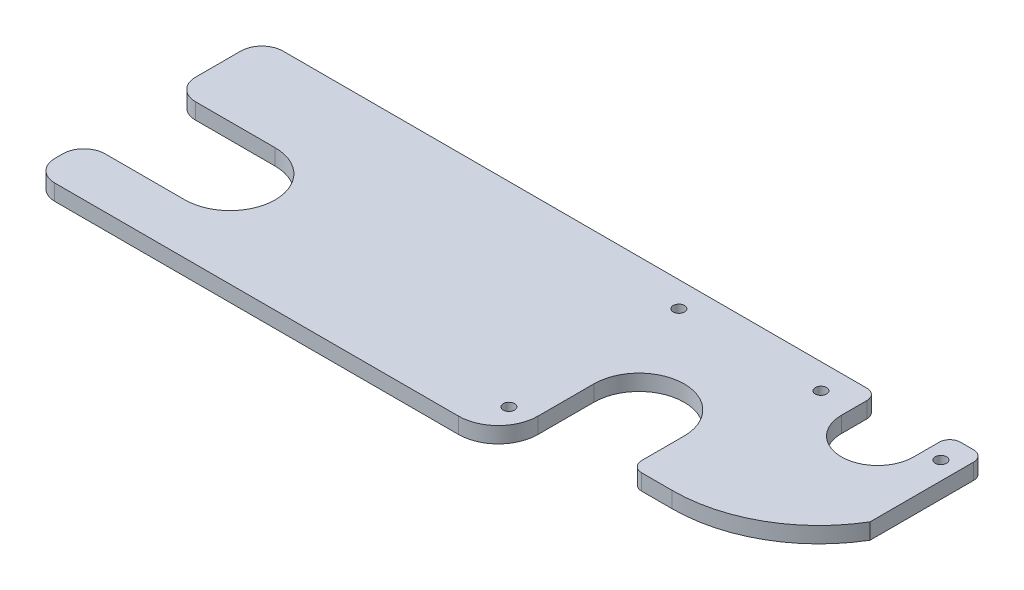
ISO-10303-21;
HEADER;
FILE_DESCRIPTION(('STEP AP214'),'2;1');
FILE_NAME('part.step','',(''),(''),'','','');
FILE_SCHEMA(('AUTOMOTIVE_DESIGN { 1 0 10303 214 1 1 1 1 }'));
ENDSEC;
DATA;
#1=APPLICATION_CONTEXT('core data for automotive mechanical design processes');
#2=APPLICATION_PROTOCOL_DEFINITION('international standard','automotive_design',2000,#1);
#3=PRODUCT_CONTEXT('',#1,'mechanical');
#4=PRODUCT('Part','Part','',(#3));
#5=PRODUCT_RELATED_PRODUCT_CATEGORY('part','',(#4));
#6=PRODUCT_DEFINITION_FORMATION('','',#4);
#7=PRODUCT_DEFINITION_CONTEXT('part definition',#1,'design');
#8=PRODUCT_DEFINITION('design','',#6,#7);
#9=PRODUCT_DEFINITION_SHAPE('','',#8);
#10=(LENGTH_UNIT() NAMED_UNIT(*) SI_UNIT(.MILLI.,.METRE.));
#11=(NAMED_UNIT(*) PLANE_ANGLE_UNIT() SI_UNIT($,.RADIAN.));
#12=(NAMED_UNIT(*) SI_UNIT($,.STERADIAN.) SOLID_ANGLE_UNIT());
#13=UNCERTAINTY_MEASURE_WITH_UNIT(LENGTH_MEASURE(1.E-05),#10,'distance_accuracy_value','');
#14=(GEOMETRIC_REPRESENTATION_CONTEXT(3) GLOBAL_UNCERTAINTY_ASSIGNED_CONTEXT((#13)) GLOBAL_UNIT_ASSIGNED_CONTEXT((#10,
#11,#12)) REPRESENTATION_CONTEXT('',''));
#15=CARTESIAN_POINT('',(0.,0.,0.));
#16=DIRECTION('',(0.,0.,1.));
#17=DIRECTION('',(1.,0.,0.));
#18=AXIS2_PLACEMENT_3D('',#15,#16,#17);
#19=CARTESIAN_POINT('',(12.7,9.525,-123.825));
#20=DIRECTION('',(0.,-1.,0.));
#21=DIRECTION('',(0.,0.,-1.));
#22=AXIS2_PLACEMENT_3D('',#19,#20,#21);
#23=CYLINDRICAL_SURFACE('',#22,12.7);
#24=CARTESIAN_POINT('',(12.7,0.,-123.825));
#25=DIRECTION('',(0.,-1.,0.));
#26=DIRECTION('',(0.,0.,-1.));
#27=AXIS2_PLACEMENT_3D('',#24,#25,#26);
#28=CIRCLE('',#27,12.7);
#29=CARTESIAN_POINT('',(0.,0.,-123.825));
#30=VERTEX_POINT('',#29);
#31=CARTESIAN_POINT('',(12.7,0.,-136.525));
#32=VERTEX_POINT('',#31);
#33=EDGE_CURVE('E382',#30,#32,#28,.T.);
#34=ORIENTED_EDGE('',*,*,#33,.F.);
#35=DIRECTION('',(0.,-1.,0.));
#36=VECTOR('',#35,1.);
#37=CARTESIAN_POINT('',(0.,9.525,-123.825));
#38=LINE('',#37,#36);
#39=CARTESIAN_POINT('',(0.,9.525,-123.825));
#40=VERTEX_POINT('',#39);
#41=EDGE_CURVE('E388',#40,#30,#38,.T.);
#42=ORIENTED_EDGE('',*,*,#41,.F.);
#43=CARTESIAN_POINT('',(12.7,9.525,-123.825));
#44=DIRECTION('',(0.,-1.,0.));
#45=DIRECTION('',(0.,0.,-1.));
#46=AXIS2_PLACEMENT_3D('',#43,#44,#45);
#47=CIRCLE('',#46,12.7);
#48=CARTESIAN_POINT('',(12.7,9.525,-136.525));
#49=VERTEX_POINT('',#48);
#50=EDGE_CURVE('E243',#40,#49,#47,.T.);
#51=ORIENTED_EDGE('',*,*,#50,.T.);
#52=DIRECTION('',(0.,-1.,0.));
#53=VECTOR('',#52,1.);
#54=CARTESIAN_POINT('',(12.7,9.525,-136.525));
#55=LINE('',#54,#53);
#56=EDGE_CURVE('E248',#49,#32,#55,.T.);
#57=ORIENTED_EDGE('',*,*,#56,.T.);
#58=EDGE_LOOP('',(#34,#42,#51,#57));
#59=FACE_BOUND('',#58,.T.);
#60=ADVANCED_FACE('F32',(#59),#23,.T.);
#61=CARTESIAN_POINT('',(0.,9.525,-96.8375000000001));
#62=DIRECTION('',(-1.,0.,0.));
#63=DIRECTION('',(0.,0.,1.));
#64=AXIS2_PLACEMENT_3D('',#61,#62,#63);
#65=PLANE('',#64);
#66=DIRECTION('',(0.,0.,-1.));
#67=VECTOR('',#66,1.);
#68=CARTESIAN_POINT('',(0.,0.,-96.8375000000001));
#69=LINE('',#68,#67);
#70=CARTESIAN_POINT('',(0.,0.,-96.8375));
#71=VERTEX_POINT('',#70);
#72=EDGE_CURVE('E380',#71,#30,#69,.T.);
#73=ORIENTED_EDGE('',*,*,#72,.F.);
#74=DIRECTION('',(0.,-1.,0.));
#75=VECTOR('',#74,1.);
#76=CARTESIAN_POINT('',(0.,9.525,-96.8375000000001));
#77=LINE('',#76,#75);
#78=CARTESIAN_POINT('',(0.,9.525,-96.8375));
#79=VERTEX_POINT('',#78);
#80=EDGE_CURVE('E270',#71,#79,#77,.F.);
#81=ORIENTED_EDGE('',*,*,#80,.T.);
#82=DIRECTION('',(0.,0.,-1.));
#83=VECTOR('',#82,1.);
#84=CARTESIAN_POINT('',(0.,9.525,-84.1375));
#85=LINE('',#84,#83);
#86=EDGE_CURVE('E343',#79,#40,#85,.T.);
#87=ORIENTED_EDGE('',*,*,#86,.T.);
#88=ORIENTED_EDGE('',*,*,#41,.T.);
#89=EDGE_LOOP('',(#73,#81,#87,#88));
#90=FACE_BOUND('',#89,.T.);
#91=ADVANCED_FACE('F448',(#90),#65,.T.);
#92=CARTESIAN_POINT('',(22.2250000000001,9.525,-84.1375));
#93=DIRECTION('',(0.,0.,1.));
#94=DIRECTION('',(1.,0.,0.));
#95=AXIS2_PLACEMENT_3D('',#92,#93,#94);
#96=PLANE('',#95);
#97=DIRECTION('',(-1.,0.,0.));
#98=VECTOR('',#97,1.);
#99=CARTESIAN_POINT('',(60.325,9.525,-84.1375));
#100=LINE('',#99,#98);
#101=CARTESIAN_POINT('',(60.325,9.525,-84.1375));
#102=VERTEX_POINT('',#101);
#103=CARTESIAN_POINT('',(12.7,9.525,-84.1375));
#104=VERTEX_POINT('',#103);
#105=EDGE_CURVE('E340',#102,#104,#100,.T.);
#106=ORIENTED_EDGE('',*,*,#105,.T.);
#107=DIRECTION('',(0.,-1.,0.));
#108=VECTOR('',#107,1.);
#109=CARTESIAN_POINT('',(12.7,9.525,-84.1375));
#110=LINE('',#109,#108);
#111=CARTESIAN_POINT('',(12.7,0.,-84.1375));
#112=VERTEX_POINT('',#111);
#113=EDGE_CURVE('E267',#104,#112,#110,.T.);
#114=ORIENTED_EDGE('',*,*,#113,.T.);
#115=DIRECTION('',(-1.,0.,0.));
#116=VECTOR('',#115,1.);
#117=CARTESIAN_POINT('',(22.2250000000001,0.,-84.1375));
#118=LINE('',#117,#116);
#119=CARTESIAN_POINT('',(60.325,0.,-84.1375));
#120=VERTEX_POINT('',#119);
#121=EDGE_CURVE('E377',#120,#112,#118,.T.);
#122=ORIENTED_EDGE('',*,*,#121,.F.);
#123=DIRECTION('',(0.,-1.,0.));
#124=VECTOR('',#123,1.);
#125=CARTESIAN_POINT('',(60.325,9.525,-84.1375));
#126=LINE('',#125,#124);
#127=EDGE_CURVE('E391',#102,#120,#126,.T.);
#128=ORIENTED_EDGE('',*,*,#127,.F.);
#129=EDGE_LOOP('',(#106,#114,#122,#128));
#130=FACE_BOUND('',#129,.T.);
#131=ADVANCED_FACE('F442',(#130),#96,.T.);
#132=CARTESIAN_POINT('',(60.325,9.525,-57.15));
#133=DIRECTION('',(0.,-1.,0.));
#134=DIRECTION('',(0.,0.,-1.));
#135=AXIS2_PLACEMENT_3D('',#132,#133,#134);
#136=CYLINDRICAL_SURFACE('',#135,26.9875);
#137=CARTESIAN_POINT('',(60.325,0.,-57.15));
#138=DIRECTION('',(0.,-1.,0.));
#139=DIRECTION('',(0.,0.,-1.));
#140=AXIS2_PLACEMENT_3D('',#137,#138,#139);
#141=CIRCLE('',#140,26.9875);
#142=CARTESIAN_POINT('',(60.325,0.,-30.1625));
#143=VERTEX_POINT('',#142);
#144=EDGE_CURVE('E375',#120,#143,#141,.T.);
#145=ORIENTED_EDGE('',*,*,#144,.T.);
#146=DIRECTION('',(0.,-1.,0.));
#147=VECTOR('',#146,1.);
#148=CARTESIAN_POINT('',(60.325,9.525,-30.1625));
#149=LINE('',#148,#147);
#150=CARTESIAN_POINT('',(60.325,9.525,-30.1625));
#151=VERTEX_POINT('',#150);
#152=EDGE_CURVE('E394',#151,#143,#149,.T.);
#153=ORIENTED_EDGE('',*,*,#152,.F.);
#154=CARTESIAN_POINT('',(60.325,9.525,-57.15));
#155=DIRECTION('',(0.,1.,0.));
#156=DIRECTION('',(0.,0.,1.));
#157=AXIS2_PLACEMENT_3D('',#154,#155,#156);
#158=CIRCLE('',#157,26.9875);
#159=EDGE_CURVE('E338',#151,#102,#158,.T.);
#160=ORIENTED_EDGE('',*,*,#159,.T.);
#161=ORIENTED_EDGE('',*,*,#127,.T.);
#162=EDGE_LOOP('',(#145,#153,#160,#161));
#163=FACE_BOUND('',#162,.T.);
#164=ADVANCED_FACE('F439',(#163),#136,.F.);
#165=CARTESIAN_POINT('',(60.325,9.525,-30.1625));
#166=DIRECTION('',(0.,0.,1.));
#167=DIRECTION('',(1.,0.,0.));
#168=AXIS2_PLACEMENT_3D('',#165,#166,#167);
#169=PLANE('',#168);
#170=DIRECTION('',(-1.,0.,0.));
#171=VECTOR('',#170,1.);
#172=CARTESIAN_POINT('',(60.325,0.,-30.1625));
#173=LINE('',#172,#171);
#174=CARTESIAN_POINT('',(12.7,0.,-30.1625));
#175=VERTEX_POINT('',#174);
#176=EDGE_CURVE('E372',#143,#175,#173,.T.);
#177=ORIENTED_EDGE('',*,*,#176,.T.);
#178=DIRECTION('',(0.,-1.,0.));
#179=VECTOR('',#178,1.);
#180=CARTESIAN_POINT('',(12.7,9.525,-30.1625));
#181=LINE('',#180,#179);
#182=CARTESIAN_POINT('',(12.7,9.525,-30.1625));
#183=VERTEX_POINT('',#182);
#184=EDGE_CURVE('E261',#175,#183,#181,.F.);
#185=ORIENTED_EDGE('',*,*,#184,.T.);
#186=DIRECTION('',(-1.,0.,0.));
#187=VECTOR('',#186,1.);
#188=CARTESIAN_POINT('',(22.2250000000001,9.525,-30.1625));
#189=LINE('',#188,#187);
#190=EDGE_CURVE('E335',#151,#183,#189,.T.);
#191=ORIENTED_EDGE('',*,*,#190,.F.);
#192=ORIENTED_EDGE('',*,*,#152,.T.);
#193=EDGE_LOOP('',(#177,#185,#191,#192));
#194=FACE_BOUND('',#193,.T.);
#195=ADVANCED_FACE('F433',(#194),#169,.F.);
#196=CARTESIAN_POINT('',(0.,9.525,-30.1625));
#197=DIRECTION('',(1.,0.,0.));
#198=DIRECTION('',(0.,0.,-1.));
#199=AXIS2_PLACEMENT_3D('',#196,#197,#198);
#200=PLANE('',#199);
#201=DIRECTION('',(0.,0.,1.));
#202=VECTOR('',#201,1.);
#203=CARTESIAN_POINT('',(0.,9.525,-17.4624999999999));
#204=LINE('',#203,#202);
#205=CARTESIAN_POINT('',(0.,9.525,-17.4625));
#206=VERTEX_POINT('',#205);
#207=CARTESIAN_POINT('',(0.,9.525,-12.7000000000001));
#208=VERTEX_POINT('',#207);
#209=EDGE_CURVE('E333',#206,#208,#204,.T.);
#210=ORIENTED_EDGE('',*,*,#209,.F.);
#211=DIRECTION('',(0.,-1.,0.));
#212=VECTOR('',#211,1.);
#213=CARTESIAN_POINT('',(0.,9.525,-17.4625));
#214=LINE('',#213,#212);
#215=CARTESIAN_POINT('',(0.,0.,-17.4625));
#216=VERTEX_POINT('',#215);
#217=EDGE_CURVE('E254',#206,#216,#214,.T.);
#218=ORIENTED_EDGE('',*,*,#217,.T.);
#219=DIRECTION('',(0.,0.,1.));
#220=VECTOR('',#219,1.);
#221=CARTESIAN_POINT('',(0.,0.,-30.1625));
#222=LINE('',#221,#220);
#223=CARTESIAN_POINT('',(0.,0.,-12.7000000000001));
#224=VERTEX_POINT('',#223);
#225=EDGE_CURVE('E370',#216,#224,#222,.T.);
#226=ORIENTED_EDGE('',*,*,#225,.T.);
#227=DIRECTION('',(0.,-1.,0.));
#228=VECTOR('',#227,1.);
#229=CARTESIAN_POINT('',(0.,9.525,-12.7000000000001));
#230=LINE('',#229,#228);
#231=EDGE_CURVE('E397',#208,#224,#230,.T.);
#232=ORIENTED_EDGE('',*,*,#231,.F.);
#233=EDGE_LOOP('',(#210,#218,#226,#232));
#234=FACE_BOUND('',#233,.T.);
#235=ADVANCED_FACE('F426',(#234),#200,.F.);
#236=CARTESIAN_POINT('',(12.7,9.525,-12.7));
#237=DIRECTION('',(0.,-1.,0.));
#238=DIRECTION('',(0.,0.,-1.));
#239=AXIS2_PLACEMENT_3D('',#236,#237,#238);
#240=CYLINDRICAL_SURFACE('',#239,12.7);
#241=CARTESIAN_POINT('',(12.7,0.,-12.7));
#242=DIRECTION('',(0.,1.,0.));
#243=DIRECTION('',(0.,0.,1.));
#244=AXIS2_PLACEMENT_3D('',#241,#242,#243);
#245=CIRCLE('',#244,12.7);
#246=CARTESIAN_POINT('',(12.7000000000001,0.,0.));
#247=VERTEX_POINT('',#246);
#248=EDGE_CURVE('E368',#224,#247,#245,.T.);
#249=ORIENTED_EDGE('',*,*,#248,.T.);
#250=DIRECTION('',(0.,-1.,0.));
#251=VECTOR('',#250,1.);
#252=CARTESIAN_POINT('',(12.7000000000001,9.525,0.));
#253=LINE('',#252,#251);
#254=CARTESIAN_POINT('',(12.7000000000001,9.525,0.));
#255=VERTEX_POINT('',#254);
#256=EDGE_CURVE('E400',#255,#247,#253,.T.);
#257=ORIENTED_EDGE('',*,*,#256,.F.);
#258=CARTESIAN_POINT('',(12.7,9.525,-12.7));
#259=DIRECTION('',(0.,1.,0.));
#260=DIRECTION('',(0.,0.,1.));
#261=AXIS2_PLACEMENT_3D('',#258,#259,#260);
#262=CIRCLE('',#261,12.7);
#263=EDGE_CURVE('E330',#208,#255,#262,.T.);
#264=ORIENTED_EDGE('',*,*,#263,.F.);
#265=ORIENTED_EDGE('',*,*,#231,.T.);
#266=EDGE_LOOP('',(#249,#257,#264,#265));
#267=FACE_BOUND('',#266,.T.);
#268=ADVANCED_FACE('F420',(#267),#240,.T.);
#269=CARTESIAN_POINT('',(12.7000000000001,9.525,0.));
#270=DIRECTION('',(0.,0.,-1.));
#271=DIRECTION('',(-1.,0.,0.));
#272=AXIS2_PLACEMENT_3D('',#269,#270,#271);
#273=PLANE('',#272);
#274=DIRECTION('',(1.,0.,0.));
#275=VECTOR('',#274,1.);
#276=CARTESIAN_POINT('',(12.7000000000001,0.,0.));
#277=LINE('',#276,#275);
#278=CARTESIAN_POINT('',(254.,0.,0.));
#279=VERTEX_POINT('',#278);
#280=EDGE_CURVE('E365',#247,#279,#277,.T.);
#281=ORIENTED_EDGE('',*,*,#280,.T.);
#282=DIRECTION('',(0.,-1.,0.));
#283=VECTOR('',#282,1.);
#284=CARTESIAN_POINT('',(254.,9.525,0.));
#285=LINE('',#284,#283);
#286=CARTESIAN_POINT('',(254.,9.525,0.));
#287=VERTEX_POINT('',#286);
#288=EDGE_CURVE('E250',#279,#287,#285,.F.);
#289=ORIENTED_EDGE('',*,*,#288,.T.);
#290=DIRECTION('',(1.,0.,0.));
#291=VECTOR('',#290,1.);
#292=CARTESIAN_POINT('',(25.4,9.525,0.));
#293=LINE('',#292,#291);
#294=EDGE_CURVE('E327',#255,#287,#293,.T.);
#295=ORIENTED_EDGE('',*,*,#294,.F.);
#296=ORIENTED_EDGE('',*,*,#256,.T.);
#297=EDGE_LOOP('',(#281,#289,#295,#296));
#298=FACE_BOUND('',#297,.T.);
#299=ADVANCED_FACE('F416',(#298),#273,.F.);
#300=CARTESIAN_POINT('',(277.8125,9.525,-57.15));
#301=DIRECTION('',(1.,0.,0.));
#302=DIRECTION('',(0.,0.,-1.));
#303=AXIS2_PLACEMENT_3D('',#300,#301,#302);
#304=PLANE('',#303);
#305=DIRECTION('',(0.,0.,1.));
#306=VECTOR('',#305,1.);
#307=CARTESIAN_POINT('',(277.8125,9.525,-57.15));
#308=LINE('',#307,#306);
#309=CARTESIAN_POINT('',(277.812500035128,9.525,-57.15));
#310=VERTEX_POINT('',#309);
#311=CARTESIAN_POINT('',(277.8125,9.525,-23.8125));
#312=VERTEX_POINT('',#311);
#313=EDGE_CURVE('E319',#310,#312,#308,.T.);
#314=ORIENTED_EDGE('',*,*,#313,.T.);
#315=DIRECTION('',(0.,-1.,0.));
#316=VECTOR('',#315,1.);
#317=CARTESIAN_POINT('',(277.8125,0.,-23.8125));
#318=LINE('',#317,#316);
#319=CARTESIAN_POINT('',(277.8125,0.,-23.8125));
#320=VERTEX_POINT('',#319);
#321=EDGE_CURVE('E244',#312,#320,#318,.T.);
#322=ORIENTED_EDGE('',*,*,#321,.T.);
#323=DIRECTION('',(0.,0.,1.));
#324=VECTOR('',#323,1.);
#325=CARTESIAN_POINT('',(277.8125,0.,-57.15));
#326=LINE('',#325,#324);
#327=CARTESIAN_POINT('',(277.812500035128,0.,-57.15));
#328=VERTEX_POINT('',#327);
#329=EDGE_CURVE('E362',#328,#320,#326,.T.);
#330=ORIENTED_EDGE('',*,*,#329,.F.);
#331=DIRECTION('',(0.,-1.,0.));
#332=VECTOR('',#331,1.);
#333=CARTESIAN_POINT('',(277.812500035128,9.525,-57.15));
#334=LINE('',#333,#332);
#335=EDGE_CURVE('E236',#310,#328,#334,.T.);
#336=ORIENTED_EDGE('',*,*,#335,.F.);
#337=EDGE_LOOP('',(#314,#322,#330,#336));
#338=FACE_BOUND('',#337,.T.);
#339=ADVANCED_FACE('F407',(#338),#304,.T.);
#340=CARTESIAN_POINT('',(304.8,9.525,-57.15));
#341=DIRECTION('',(0.,-1.,0.));
#342=DIRECTION('',(0.,0.,-1.));
#343=AXIS2_PLACEMENT_3D('',#340,#341,#342);
#344=CYLINDRICAL_SURFACE('',#343,26.9874999648723);
#345=CARTESIAN_POINT('',(304.8,0.,-57.15));
#346=DIRECTION('',(0.,-1.,0.));
#347=DIRECTION('',(0.,0.,-1.));
#348=AXIS2_PLACEMENT_3D('',#345,#346,#347);
#349=CIRCLE('',#348,26.9874999648723);
#350=CARTESIAN_POINT('',(331.787499929745,0.,-57.15));
#351=VERTEX_POINT('',#350);
#352=EDGE_CURVE('E360',#328,#351,#349,.T.);
#353=ORIENTED_EDGE('',*,*,#352,.T.);
#354=DIRECTION('',(0.,-1.,0.));
#355=VECTOR('',#354,1.);
#356=CARTESIAN_POINT('',(331.787499929745,9.525,-57.15));
#357=LINE('',#356,#355);
#358=CARTESIAN_POINT('',(331.787499929745,9.525,-57.15));
#359=VERTEX_POINT('',#358);
#360=EDGE_CURVE('E232',#359,#351,#357,.T.);
#361=ORIENTED_EDGE('',*,*,#360,.F.);
#362=CARTESIAN_POINT('',(304.8,9.525,-57.15));
#363=DIRECTION('',(0.,-1.,0.));
#364=DIRECTION('',(0.,0.,-1.));
#365=AXIS2_PLACEMENT_3D('',#362,#363,#364);
#366=CIRCLE('',#365,26.9874999648723);
#367=EDGE_CURVE('E316',#310,#359,#366,.T.);
#368=ORIENTED_EDGE('',*,*,#367,.F.);
#369=ORIENTED_EDGE('',*,*,#335,.T.);
#370=EDGE_LOOP('',(#353,#361,#368,#369));
#371=FACE_BOUND('',#370,.T.);
#372=ADVANCED_FACE('F404',(#371),#344,.F.);
#373=CARTESIAN_POINT('',(331.787499929745,9.525,-57.15));
#374=DIRECTION('',(1.,0.,0.));
#375=DIRECTION('',(0.,0.,-1.));
#376=AXIS2_PLACEMENT_3D('',#373,#374,#375);
#377=PLANE('',#376);
#378=DIRECTION('',(0.,0.,1.));
#379=VECTOR('',#378,1.);
#380=CARTESIAN_POINT('',(331.787499929745,0.,-57.15));
#381=LINE('',#380,#379);
#382=CARTESIAN_POINT('',(331.787499929745,0.,-31.75));
#383=VERTEX_POINT('',#382);
#384=EDGE_CURVE('E217',#351,#383,#381,.T.);
#385=ORIENTED_EDGE('',*,*,#384,.T.);
#386=DIRECTION('',(0.,1.,0.));
#387=VECTOR('',#386,1.);
#388=CARTESIAN_POINT('',(331.787499929745,9.525,-31.75));
#389=LINE('',#388,#387);
#390=CARTESIAN_POINT('',(331.787499929745,9.525,-31.75));
#391=VERTEX_POINT('',#390);
#392=EDGE_CURVE('E40',#383,#391,#389,.T.);
#393=ORIENTED_EDGE('',*,*,#392,.T.);
#394=DIRECTION('',(0.,0.,1.));
#395=VECTOR('',#394,1.);
#396=CARTESIAN_POINT('',(331.787499929745,9.525,-57.15));
#397=LINE('',#396,#395);
#398=EDGE_CURVE('E306',#359,#391,#397,.T.);
#399=ORIENTED_EDGE('',*,*,#398,.F.);
#400=ORIENTED_EDGE('',*,*,#360,.T.);
#401=EDGE_LOOP('',(#385,#393,#399,#400));
#402=FACE_BOUND('',#401,.T.);
#403=ADVANCED_FACE('F305',(#402),#377,.F.);
#404=CARTESIAN_POINT('',(431.8,9.525,-136.525));
#405=DIRECTION('',(1.,0.,0.));
#406=DIRECTION('',(0.,0.,-1.));
#407=AXIS2_PLACEMENT_3D('',#404,#405,#406);
#408=PLANE('',#407);
#409=DIRECTION('',(0.,0.,1.));
#410=VECTOR('',#409,1.);
#411=CARTESIAN_POINT('',(431.8,0.,-136.525));
#412=LINE('',#411,#410);
#413=CARTESIAN_POINT('',(431.8,0.,-130.175));
#414=VERTEX_POINT('',#413);
#415=CARTESIAN_POINT('',(431.8,0.,-68.2625));
#416=VERTEX_POINT('',#415);
#417=EDGE_CURVE('E206',#414,#416,#412,.T.);
#418=ORIENTED_EDGE('',*,*,#417,.F.);
#419=DIRECTION('',(0.,-1.,0.));
#420=VECTOR('',#419,1.);
#421=CARTESIAN_POINT('',(431.8,9.525,-130.175));
#422=LINE('',#421,#420);
#423=CARTESIAN_POINT('',(431.8,9.525,-130.175));
#424=VERTEX_POINT('',#423);
#425=EDGE_CURVE('E295',#414,#424,#422,.F.);
#426=ORIENTED_EDGE('',*,*,#425,.T.);
#427=DIRECTION('',(0.,0.,1.));
#428=VECTOR('',#427,1.);
#429=CARTESIAN_POINT('',(431.8,9.525,-136.525));
#430=LINE('',#429,#428);
#431=CARTESIAN_POINT('',(431.8,9.525,-68.2625));
#432=VERTEX_POINT('',#431);
#433=EDGE_CURVE('E231',#424,#432,#430,.T.);
#434=ORIENTED_EDGE('',*,*,#433,.T.);
#435=DIRECTION('',(0.,-1.,0.));
#436=VECTOR('',#435,1.);
#437=CARTESIAN_POINT('',(431.8,9.525,-68.2625));
#438=LINE('',#437,#436);
#439=EDGE_CURVE('E225',#432,#416,#438,.T.);
#440=ORIENTED_EDGE('',*,*,#439,.T.);
#441=EDGE_LOOP('',(#418,#426,#434,#440));
#442=FACE_BOUND('',#441,.T.);
#443=ADVANCED_FACE('F230',(#442),#408,.T.);
#444=CARTESIAN_POINT('',(411.226,9.525,-136.525));
#445=DIRECTION('',(0.,0.,-1.));
#446=DIRECTION('',(-1.,0.,0.));
#447=AXIS2_PLACEMENT_3D('',#444,#445,#446);
#448=PLANE('',#447);
#449=DIRECTION('',(1.,0.,0.));
#450=VECTOR('',#449,1.);
#451=CARTESIAN_POINT('',(411.226,9.525,-136.525));
#452=LINE('',#451,#450);
#453=CARTESIAN_POINT('',(417.576,9.525,-136.525));
#454=VERTEX_POINT('',#453);
#455=CARTESIAN_POINT('',(425.45,9.525,-136.525));
#456=VERTEX_POINT('',#455);
#457=EDGE_CURVE('E321',#454,#456,#452,.T.);
#458=ORIENTED_EDGE('',*,*,#457,.T.);
#459=DIRECTION('',(0.,-1.,0.));
#460=VECTOR('',#459,1.);
#461=CARTESIAN_POINT('',(425.45,9.525,-136.525));
#462=LINE('',#461,#460);
#463=CARTESIAN_POINT('',(425.45,0.,-136.525));
#464=VERTEX_POINT('',#463);
#465=EDGE_CURVE('E292',#456,#464,#462,.T.);
#466=ORIENTED_EDGE('',*,*,#465,.T.);
#467=DIRECTION('',(1.,0.,0.));
#468=VECTOR('',#467,1.);
#469=CARTESIAN_POINT('',(411.226,0.,-136.525));
#470=LINE('',#469,#468);
#471=CARTESIAN_POINT('',(417.576,0.,-136.525));
#472=VERTEX_POINT('',#471);
#473=EDGE_CURVE('E218',#472,#464,#470,.T.);
#474=ORIENTED_EDGE('',*,*,#473,.F.);
#475=DIRECTION('',(0.,-1.,0.));
#476=VECTOR('',#475,1.);
#477=CARTESIAN_POINT('',(417.576,9.525,-136.525));
#478=LINE('',#477,#476);
#479=EDGE_CURVE('E290',#472,#454,#478,.F.);
#480=ORIENTED_EDGE('',*,*,#479,.T.);
#481=EDGE_LOOP('',(#458,#466,#474,#480));
#482=FACE_BOUND('',#481,.T.);
#483=ADVANCED_FACE('F481',(#482),#448,.T.);
#484=CARTESIAN_POINT('',(411.226,9.525,-114.935));
#485=DIRECTION('',(-1.,0.,0.));
#486=DIRECTION('',(0.,0.,1.));
#487=AXIS2_PLACEMENT_3D('',#484,#485,#486);
#488=PLANE('',#487);
#489=DIRECTION('',(0.,0.,-1.));
#490=VECTOR('',#489,1.);
#491=CARTESIAN_POINT('',(411.226,9.525,-114.935));
#492=LINE('',#491,#490);
#493=CARTESIAN_POINT('',(411.226,9.525,-114.935));
#494=VERTEX_POINT('',#493);
#495=CARTESIAN_POINT('',(411.226,9.525,-130.175));
#496=VERTEX_POINT('',#495);
#497=EDGE_CURVE('E474',#494,#496,#492,.T.);
#498=ORIENTED_EDGE('',*,*,#497,.T.);
#499=DIRECTION('',(0.,-1.,0.));
#500=VECTOR('',#499,1.);
#501=CARTESIAN_POINT('',(411.226,9.525,-130.175));
#502=LINE('',#501,#500);
#503=CARTESIAN_POINT('',(411.226,0.,-130.175));
#504=VERTEX_POINT('',#503);
#505=EDGE_CURVE('E297',#496,#504,#502,.T.);
#506=ORIENTED_EDGE('',*,*,#505,.T.);
#507=DIRECTION('',(0.,0.,-1.));
#508=VECTOR('',#507,1.);
#509=CARTESIAN_POINT('',(411.226,0.,-114.935));
#510=LINE('',#509,#508);
#511=CARTESIAN_POINT('',(411.226,0.,-114.935));
#512=VERTEX_POINT('',#511);
#513=EDGE_CURVE('E355',#512,#504,#510,.T.);
#514=ORIENTED_EDGE('',*,*,#513,.F.);
#515=DIRECTION('',(0.,-1.,0.));
#516=VECTOR('',#515,1.);
#517=CARTESIAN_POINT('',(411.226,9.525,-114.935));
#518=LINE('',#517,#516);
#519=EDGE_CURVE('E233',#494,#512,#518,.T.);
#520=ORIENTED_EDGE('',*,*,#519,.F.);
#521=EDGE_LOOP('',(#498,#506,#514,#520));
#522=FACE_BOUND('',#521,.T.);
#523=ADVANCED_FACE('F532',(#522),#488,.T.);
#524=CARTESIAN_POINT('',(389.636,9.525,-114.935));
#525=DIRECTION('',(0.,-1.,0.));
#526=DIRECTION('',(0.,0.,-1.));
#527=AXIS2_PLACEMENT_3D('',#524,#525,#526);
#528=CYLINDRICAL_SURFACE('',#527,21.59);
#529=CARTESIAN_POINT('',(389.636,0.,-114.935));
#530=DIRECTION('',(0.,1.,0.));
#531=DIRECTION('',(0.,0.,1.));
#532=AXIS2_PLACEMENT_3D('',#529,#530,#531);
#533=CIRCLE('',#532,21.59);
#534=CARTESIAN_POINT('',(368.046,0.,-114.935));
#535=VERTEX_POINT('',#534);
#536=EDGE_CURVE('E352',#535,#512,#533,.T.);
#537=ORIENTED_EDGE('',*,*,#536,.F.);
#538=DIRECTION('',(0.,-1.,0.));
#539=VECTOR('',#538,1.);
#540=CARTESIAN_POINT('',(368.046,9.525,-114.935));
#541=LINE('',#540,#539);
#542=CARTESIAN_POINT('',(368.046,9.525,-114.935));
#543=VERTEX_POINT('',#542);
#544=EDGE_CURVE('E238',#543,#535,#541,.T.);
#545=ORIENTED_EDGE('',*,*,#544,.F.);
#546=CARTESIAN_POINT('',(389.636,9.525,-114.935));
#547=DIRECTION('',(0.,1.,0.));
#548=DIRECTION('',(0.,0.,1.));
#549=AXIS2_PLACEMENT_3D('',#546,#547,#548);
#550=CIRCLE('',#549,21.59);
#551=EDGE_CURVE('E472',#543,#494,#550,.T.);
#552=ORIENTED_EDGE('',*,*,#551,.T.);
#553=ORIENTED_EDGE('',*,*,#519,.T.);
#554=EDGE_LOOP('',(#537,#545,#552,#553));
#555=FACE_BOUND('',#554,.T.);
#556=ADVANCED_FACE('F535',(#555),#528,.F.);
#557=CARTESIAN_POINT('',(368.046,9.525,-114.935));
#558=DIRECTION('',(-1.,0.,0.));
#559=DIRECTION('',(0.,0.,1.));
#560=AXIS2_PLACEMENT_3D('',#557,#558,#559);
#561=PLANE('',#560);
#562=DIRECTION('',(0.,0.,-1.));
#563=VECTOR('',#562,1.);
#564=CARTESIAN_POINT('',(368.046,0.,-114.935));
#565=LINE('',#564,#563);
#566=CARTESIAN_POINT('',(368.046,0.,-130.175));
#567=VERTEX_POINT('',#566);
#568=EDGE_CURVE('E349',#535,#567,#565,.T.);
#569=ORIENTED_EDGE('',*,*,#568,.T.);
#570=DIRECTION('',(0.,-1.,0.));
#571=VECTOR('',#570,1.);
#572=CARTESIAN_POINT('',(368.046,9.525,-130.175));
#573=LINE('',#572,#571);
#574=CARTESIAN_POINT('',(368.046,9.525,-130.175));
#575=VERTEX_POINT('',#574);
#576=EDGE_CURVE('E282',#567,#575,#573,.F.);
#577=ORIENTED_EDGE('',*,*,#576,.T.);
#578=DIRECTION('',(0.,0.,-1.));
#579=VECTOR('',#578,1.);
#580=CARTESIAN_POINT('',(368.046,9.525,-114.935));
#581=LINE('',#580,#579);
#582=EDGE_CURVE('E469',#543,#575,#581,.T.);
#583=ORIENTED_EDGE('',*,*,#582,.F.);
#584=ORIENTED_EDGE('',*,*,#544,.T.);
#585=EDGE_LOOP('',(#569,#577,#583,#584));
#586=FACE_BOUND('',#585,.T.);
#587=ADVANCED_FACE('F468',(#586),#561,.F.);
#588=CARTESIAN_POINT('',(23.8125,9.525,-136.525));
#589=DIRECTION('',(0.,0.,-1.));
#590=DIRECTION('',(-1.,0.,0.));
#591=AXIS2_PLACEMENT_3D('',#588,#589,#590);
#592=PLANE('',#591);
#593=DIRECTION('',(1.,0.,0.));
#594=VECTOR('',#593,1.);
#595=CARTESIAN_POINT('',(12.7000000000001,9.525,-136.525));
#596=LINE('',#595,#594);
#597=CARTESIAN_POINT('',(361.696,9.525,-136.525));
#598=VERTEX_POINT('',#597);
#599=EDGE_CURVE('E385',#49,#598,#596,.T.);
#600=ORIENTED_EDGE('',*,*,#599,.T.);
#601=DIRECTION('',(0.,-1.,0.));
#602=VECTOR('',#601,1.);
#603=CARTESIAN_POINT('',(361.696,0.,-136.525));
#604=LINE('',#603,#602);
#605=CARTESIAN_POINT('',(361.696,0.,-136.525));
#606=VERTEX_POINT('',#605);
#607=EDGE_CURVE('E272',#598,#606,#604,.T.);
#608=ORIENTED_EDGE('',*,*,#607,.T.);
#609=DIRECTION('',(1.,0.,0.));
#610=VECTOR('',#609,1.);
#611=CARTESIAN_POINT('',(23.8125,0.,-136.525));
#612=LINE('',#611,#610);
#613=EDGE_CURVE('E347',#32,#606,#612,.T.);
#614=ORIENTED_EDGE('',*,*,#613,.F.);
#615=ORIENTED_EDGE('',*,*,#56,.F.);
#616=EDGE_LOOP('',(#600,#608,#614,#615));
#617=FACE_BOUND('',#616,.T.);
#618=ADVANCED_FACE('F460',(#617),#592,.T.);
#619=CARTESIAN_POINT('',(389.636,9.525,-114.935));
#620=DIRECTION('',(0.,1.,0.));
#621=DIRECTION('',(0.,0.,1.));
#622=AXIS2_PLACEMENT_3D('',#619,#620,#621);
#623=PLANE('',#622);
#624=CARTESIAN_POINT('',(420.954199999999,9.525,-121.443750000001));
#625=DIRECTION('',(0.,1.,0.));
#626=DIRECTION('',(0.,0.,1.));
#627=AXIS2_PLACEMENT_3D('',#624,#625,#626);
#628=CIRCLE('',#627,3.3782);
#629=CARTESIAN_POINT('',(420.954199999999,9.525,-118.065550000001));
#630=VERTEX_POINT('',#629);
#631=EDGE_CURVE('E789',#630,#630,#628,.T.);
#632=ORIENTED_EDGE('',*,*,#631,.F.);
#633=EDGE_LOOP('',(#632));
#634=FACE_BOUND('',#633,.T.);
#635=CARTESIAN_POINT('',(349.269049999999,9.525,-121.443750000001));
#636=DIRECTION('',(0.,1.,0.));
#637=DIRECTION('',(0.,0.,1.));
#638=AXIS2_PLACEMENT_3D('',#635,#636,#637);
#639=CIRCLE('',#638,3.3782);
#640=CARTESIAN_POINT('',(349.269049999999,9.525,-118.065550000001));
#641=VERTEX_POINT('',#640);
#642=EDGE_CURVE('E793',#641,#641,#639,.T.);
#643=ORIENTED_EDGE('',*,*,#642,.F.);
#644=EDGE_LOOP('',(#643));
#645=FACE_BOUND('',#644,.T.);
#646=CARTESIAN_POINT('',(264.318750035127,9.525,-121.443750000001));
#647=DIRECTION('',(0.,1.,0.));
#648=DIRECTION('',(0.,0.,1.));
#649=AXIS2_PLACEMENT_3D('',#646,#647,#648);
#650=CIRCLE('',#649,3.3782);
#651=CARTESIAN_POINT('',(264.318750035127,9.525,-118.065550000001));
#652=VERTEX_POINT('',#651);
#653=EDGE_CURVE('E797',#652,#652,#650,.T.);
#654=ORIENTED_EDGE('',*,*,#653,.F.);
#655=EDGE_LOOP('',(#654));
#656=FACE_BOUND('',#655,.T.);
#657=CARTESIAN_POINT('',(264.318750035127,9.525,-19.84375));
#658=DIRECTION('',(0.,1.,0.));
#659=DIRECTION('',(0.,0.,1.));
#660=AXIS2_PLACEMENT_3D('',#657,#658,#659);
#661=CIRCLE('',#660,3.3782);
#662=CARTESIAN_POINT('',(264.318750035127,9.525,-16.46555));
#663=VERTEX_POINT('',#662);
#664=EDGE_CURVE('E800',#663,#663,#661,.T.);
#665=ORIENTED_EDGE('',*,*,#664,.F.);
#666=EDGE_LOOP('',(#665));
#667=FACE_BOUND('',#666,.T.);
#668=ORIENTED_EDGE('',*,*,#582,.T.);
#669=CARTESIAN_POINT('',(361.696,9.525,-130.175));
#670=DIRECTION('',(0.,1.,0.));
#671=DIRECTION('',(0.,0.,1.));
#672=AXIS2_PLACEMENT_3D('',#669,#670,#671);
#673=CIRCLE('',#672,6.35);
#674=EDGE_CURVE('E288',#575,#598,#673,.T.);
#675=ORIENTED_EDGE('',*,*,#674,.T.);
#676=ORIENTED_EDGE('',*,*,#599,.F.);
#677=ORIENTED_EDGE('',*,*,#50,.F.);
#678=ORIENTED_EDGE('',*,*,#86,.F.);
#679=CARTESIAN_POINT('',(12.7,9.525,-96.8375));
#680=DIRECTION('',(0.,1.,0.));
#681=DIRECTION('',(0.,0.,1.));
#682=AXIS2_PLACEMENT_3D('',#679,#680,#681);
#683=CIRCLE('',#682,12.7);
#684=EDGE_CURVE('E263',#79,#104,#683,.T.);
#685=ORIENTED_EDGE('',*,*,#684,.T.);
#686=ORIENTED_EDGE('',*,*,#105,.F.);
#687=ORIENTED_EDGE('',*,*,#159,.F.);
#688=ORIENTED_EDGE('',*,*,#190,.T.);
#689=CARTESIAN_POINT('',(12.7,9.525,-17.4625));
#690=DIRECTION('',(0.,1.,0.));
#691=DIRECTION('',(0.,0.,1.));
#692=AXIS2_PLACEMENT_3D('',#689,#690,#691);
#693=CIRCLE('',#692,12.7);
#694=EDGE_CURVE('E265',#183,#206,#693,.T.);
#695=ORIENTED_EDGE('',*,*,#694,.T.);
#696=ORIENTED_EDGE('',*,*,#209,.T.);
#697=ORIENTED_EDGE('',*,*,#263,.T.);
#698=ORIENTED_EDGE('',*,*,#294,.T.);
#699=CARTESIAN_POINT('',(254.,9.525,-23.8125));
#700=DIRECTION('',(0.,1.,0.));
#701=DIRECTION('',(0.,0.,1.));
#702=AXIS2_PLACEMENT_3D('',#699,#700,#701);
#703=CIRCLE('',#702,23.8125);
#704=EDGE_CURVE('E252',#287,#312,#703,.T.);
#705=ORIENTED_EDGE('',*,*,#704,.T.);
#706=ORIENTED_EDGE('',*,*,#313,.F.);
#707=ORIENTED_EDGE('',*,*,#367,.T.);
#708=ORIENTED_EDGE('',*,*,#398,.T.);
#709=CARTESIAN_POINT('',(338.137499929745,9.525,-31.75));
#710=DIRECTION('',(0.,1.,0.));
#711=DIRECTION('',(0.,0.,1.));
#712=AXIS2_PLACEMENT_3D('',#709,#710,#711);
#713=CIRCLE('',#712,6.35);
#714=CARTESIAN_POINT('',(338.137499929745,9.525,-25.4));
#715=VERTEX_POINT('',#714);
#716=EDGE_CURVE('E284',#391,#715,#713,.T.);
#717=ORIENTED_EDGE('',*,*,#716,.T.);
#718=DIRECTION('',(-1.,0.,0.));
#719=VECTOR('',#718,1.);
#720=CARTESIAN_POINT('',(331.787499929745,9.525,-25.4));
#721=LINE('',#720,#719);
#722=CARTESIAN_POINT('',(356.39375,9.525,-25.4));
#723=VERTEX_POINT('',#722);
#724=EDGE_CURVE('E487',#723,#715,#721,.T.);
#725=ORIENTED_EDGE('',*,*,#724,.F.);
#726=CARTESIAN_POINT('',(356.39375,9.525,-113.160821759259));
#727=DIRECTION('',(0.,-1.,0.));
#728=DIRECTION('',(0.,0.,1.));
#729=AXIS2_PLACEMENT_3D('',#726,#727,#728);
#730=CIRCLE('',#729,87.7608217592593);
#731=EDGE_CURVE('E486',#432,#723,#730,.T.);
#732=ORIENTED_EDGE('',*,*,#731,.F.);
#733=ORIENTED_EDGE('',*,*,#433,.F.);
#734=CARTESIAN_POINT('',(425.45,9.525,-130.175));
#735=DIRECTION('',(0.,1.,0.));
#736=DIRECTION('',(0.,0.,1.));
#737=AXIS2_PLACEMENT_3D('',#734,#735,#736);
#738=CIRCLE('',#737,6.35);
#739=EDGE_CURVE('E53',#424,#456,#738,.T.);
#740=ORIENTED_EDGE('',*,*,#739,.T.);
#741=ORIENTED_EDGE('',*,*,#457,.F.);
#742=CARTESIAN_POINT('',(417.576,9.525,-130.175));
#743=DIRECTION('',(0.,1.,0.));
#744=DIRECTION('',(0.,0.,1.));
#745=AXIS2_PLACEMENT_3D('',#742,#743,#744);
#746=CIRCLE('',#745,6.35);
#747=EDGE_CURVE('E47',#454,#496,#746,.T.);
#748=ORIENTED_EDGE('',*,*,#747,.T.);
#749=ORIENTED_EDGE('',*,*,#497,.F.);
#750=ORIENTED_EDGE('',*,*,#551,.F.);
#751=EDGE_LOOP('',(#668,#675,#676,#677,#678,#685,#686,#687,#688,#695,#696,#697,#698,#705,#706,
#707,#708,#717,#725,#732,#733,#740,#741,#748,#749,#750));
#752=FACE_BOUND('',#751,.T.);
#753=ADVANCED_FACE('F311',(#634,#645,#656,#667,#752),#623,.T.);
#754=CARTESIAN_POINT('',(389.636,0.,-114.935));
#755=DIRECTION('',(0.,1.,0.));
#756=DIRECTION('',(0.,0.,1.));
#757=AXIS2_PLACEMENT_3D('',#754,#755,#756);
#758=PLANE('',#757);
#759=CARTESIAN_POINT('',(420.954199999999,0.,-121.443750000001));
#760=DIRECTION('',(0.,1.,0.));
#761=DIRECTION('',(0.,0.,1.));
#762=AXIS2_PLACEMENT_3D('',#759,#760,#761);
#763=CIRCLE('',#762,3.3782);
#764=CARTESIAN_POINT('',(420.954199999999,0.,-118.065550000001));
#765=VERTEX_POINT('',#764);
#766=EDGE_CURVE('E814',#765,#765,#763,.T.);
#767=ORIENTED_EDGE('',*,*,#766,.T.);
#768=EDGE_LOOP('',(#767));
#769=FACE_BOUND('',#768,.T.);
#770=CARTESIAN_POINT('',(349.269049999999,0.,-121.443750000001));
#771=DIRECTION('',(0.,1.,0.));
#772=DIRECTION('',(0.,0.,1.));
#773=AXIS2_PLACEMENT_3D('',#770,#771,#772);
#774=CIRCLE('',#773,3.3782);
#775=CARTESIAN_POINT('',(349.269049999999,0.,-118.065550000001));
#776=VERTEX_POINT('',#775);
#777=EDGE_CURVE('E810',#776,#776,#774,.T.);
#778=ORIENTED_EDGE('',*,*,#777,.T.);
#779=EDGE_LOOP('',(#778));
#780=FACE_BOUND('',#779,.T.);
#781=CARTESIAN_POINT('',(264.318750035127,0.,-121.443750000001));
#782=DIRECTION('',(0.,1.,0.));
#783=DIRECTION('',(0.,0.,1.));
#784=AXIS2_PLACEMENT_3D('',#781,#782,#783);
#785=CIRCLE('',#784,3.3782);
#786=CARTESIAN_POINT('',(264.318750035127,0.,-118.065550000001));
#787=VERTEX_POINT('',#786);
#788=EDGE_CURVE('E802',#787,#787,#785,.T.);
#789=ORIENTED_EDGE('',*,*,#788,.T.);
#790=EDGE_LOOP('',(#789));
#791=FACE_BOUND('',#790,.T.);
#792=CARTESIAN_POINT('',(264.318750035127,0.,-19.84375));
#793=DIRECTION('',(0.,1.,0.));
#794=DIRECTION('',(0.,0.,1.));
#795=AXIS2_PLACEMENT_3D('',#792,#793,#794);
#796=CIRCLE('',#795,3.3782);
#797=CARTESIAN_POINT('',(264.318750035127,0.,-16.46555));
#798=VERTEX_POINT('',#797);
#799=EDGE_CURVE('E490',#798,#798,#796,.T.);
#800=ORIENTED_EDGE('',*,*,#799,.T.);
#801=EDGE_LOOP('',(#800));
#802=FACE_BOUND('',#801,.T.);
#803=ORIENTED_EDGE('',*,*,#613,.T.);
#804=CARTESIAN_POINT('',(361.696,0.,-130.175));
#805=DIRECTION('',(0.,1.,0.));
#806=DIRECTION('',(0.,0.,1.));
#807=AXIS2_PLACEMENT_3D('',#804,#805,#806);
#808=CIRCLE('',#807,6.35);
#809=EDGE_CURVE('E280',#606,#567,#808,.F.);
#810=ORIENTED_EDGE('',*,*,#809,.T.);
#811=ORIENTED_EDGE('',*,*,#568,.F.);
#812=ORIENTED_EDGE('',*,*,#536,.T.);
#813=ORIENTED_EDGE('',*,*,#513,.T.);
#814=CARTESIAN_POINT('',(417.576,0.,-130.175));
#815=DIRECTION('',(0.,1.,0.));
#816=DIRECTION('',(0.,0.,1.));
#817=AXIS2_PLACEMENT_3D('',#814,#815,#816);
#818=CIRCLE('',#817,6.35);
#819=EDGE_CURVE('E277',#504,#472,#818,.F.);
#820=ORIENTED_EDGE('',*,*,#819,.T.);
#821=ORIENTED_EDGE('',*,*,#473,.T.);
#822=CARTESIAN_POINT('',(425.45,0.,-130.175));
#823=DIRECTION('',(0.,1.,0.));
#824=DIRECTION('',(0.,0.,1.));
#825=AXIS2_PLACEMENT_3D('',#822,#823,#824);
#826=CIRCLE('',#825,6.35);
#827=EDGE_CURVE('E213',#464,#414,#826,.F.);
#828=ORIENTED_EDGE('',*,*,#827,.T.);
#829=ORIENTED_EDGE('',*,*,#417,.T.);
#830=CARTESIAN_POINT('',(356.39375,0.,-113.160821759259));
#831=DIRECTION('',(0.,-1.,0.));
#832=DIRECTION('',(0.,0.,1.));
#833=AXIS2_PLACEMENT_3D('',#830,#831,#832);
#834=CIRCLE('',#833,87.7608217592593);
#835=CARTESIAN_POINT('',(356.39375,0.,-25.4));
#836=VERTEX_POINT('',#835);
#837=EDGE_CURVE('E211',#416,#836,#834,.T.);
#838=ORIENTED_EDGE('',*,*,#837,.T.);
#839=DIRECTION('',(-1.,0.,0.));
#840=VECTOR('',#839,1.);
#841=CARTESIAN_POINT('',(331.787499929745,0.,-25.4));
#842=LINE('',#841,#840);
#843=CARTESIAN_POINT('',(338.137499929745,0.,-25.4));
#844=VERTEX_POINT('',#843);
#845=EDGE_CURVE('E228',#836,#844,#842,.T.);
#846=ORIENTED_EDGE('',*,*,#845,.T.);
#847=CARTESIAN_POINT('',(338.137499929745,0.,-31.75));
#848=DIRECTION('',(0.,1.,0.));
#849=DIRECTION('',(0.,0.,1.));
#850=AXIS2_PLACEMENT_3D('',#847,#848,#849);
#851=CIRCLE('',#850,6.35);
#852=EDGE_CURVE('E275',#844,#383,#851,.F.);
#853=ORIENTED_EDGE('',*,*,#852,.T.);
#854=ORIENTED_EDGE('',*,*,#384,.F.);
#855=ORIENTED_EDGE('',*,*,#352,.F.);
#856=ORIENTED_EDGE('',*,*,#329,.T.);
#857=CARTESIAN_POINT('',(254.,0.,-23.8125));
#858=DIRECTION('',(0.,1.,0.));
#859=DIRECTION('',(0.,0.,1.));
#860=AXIS2_PLACEMENT_3D('',#857,#858,#859);
#861=CIRCLE('',#860,23.8125);
#862=EDGE_CURVE('E247',#320,#279,#861,.F.);
#863=ORIENTED_EDGE('',*,*,#862,.T.);
#864=ORIENTED_EDGE('',*,*,#280,.F.);
#865=ORIENTED_EDGE('',*,*,#248,.F.);
#866=ORIENTED_EDGE('',*,*,#225,.F.);
#867=CARTESIAN_POINT('',(12.7,0.,-17.4625));
#868=DIRECTION('',(0.,1.,0.));
#869=DIRECTION('',(0.,0.,1.));
#870=AXIS2_PLACEMENT_3D('',#867,#868,#869);
#871=CIRCLE('',#870,12.7);
#872=EDGE_CURVE('E259',#216,#175,#871,.F.);
#873=ORIENTED_EDGE('',*,*,#872,.T.);
#874=ORIENTED_EDGE('',*,*,#176,.F.);
#875=ORIENTED_EDGE('',*,*,#144,.F.);
#876=ORIENTED_EDGE('',*,*,#121,.T.);
#877=CARTESIAN_POINT('',(12.7,0.,-96.8375));
#878=DIRECTION('',(0.,1.,0.));
#879=DIRECTION('',(0.,0.,1.));
#880=AXIS2_PLACEMENT_3D('',#877,#878,#879);
#881=CIRCLE('',#880,12.7);
#882=EDGE_CURVE('E257',#112,#71,#881,.F.);
#883=ORIENTED_EDGE('',*,*,#882,.T.);
#884=ORIENTED_EDGE('',*,*,#72,.T.);
#885=ORIENTED_EDGE('',*,*,#33,.T.);
#886=EDGE_LOOP('',(#803,#810,#811,#812,#813,#820,#821,#828,#829,#838,#846,#853,#854,#855,#856,
#863,#864,#865,#866,#873,#874,#875,#876,#883,#884,#885));
#887=FACE_BOUND('',#886,.T.);
#888=ADVANCED_FACE('F209',(#769,#780,#791,#802,#887),#758,.F.);
#889=CARTESIAN_POINT('',(331.787499929745,0.,-25.4));
#890=DIRECTION('',(0.,0.,-1.));
#891=DIRECTION('',(-1.,0.,0.));
#892=AXIS2_PLACEMENT_3D('',#889,#890,#891);
#893=PLANE('',#892);
#894=ORIENTED_EDGE('',*,*,#724,.T.);
#895=DIRECTION('',(0.,1.,0.));
#896=VECTOR('',#895,1.);
#897=CARTESIAN_POINT('',(338.137499929745,0.,-25.4));
#898=LINE('',#897,#896);
#899=EDGE_CURVE('E11',#715,#844,#898,.F.);
#900=ORIENTED_EDGE('',*,*,#899,.T.);
#901=ORIENTED_EDGE('',*,*,#845,.F.);
#902=DIRECTION('',(0.,1.,0.));
#903=VECTOR('',#902,1.);
#904=CARTESIAN_POINT('',(356.39375,0.,-25.4));
#905=LINE('',#904,#903);
#906=EDGE_CURVE('E227',#836,#723,#905,.T.);
#907=ORIENTED_EDGE('',*,*,#906,.T.);
#908=EDGE_LOOP('',(#894,#900,#901,#907));
#909=FACE_BOUND('',#908,.T.);
#910=ADVANCED_FACE('F493',(#909),#893,.F.);
#911=CARTESIAN_POINT('',(356.39375,0.,-113.160821759259));
#912=DIRECTION('',(0.,1.,0.));
#913=DIRECTION('',(0.,0.,1.));
#914=AXIS2_PLACEMENT_3D('',#911,#912,#913);
#915=CYLINDRICAL_SURFACE('',#914,87.7608217592593);
#916=ORIENTED_EDGE('',*,*,#731,.T.);
#917=ORIENTED_EDGE('',*,*,#906,.F.);
#918=ORIENTED_EDGE('',*,*,#837,.F.);
#919=ORIENTED_EDGE('',*,*,#439,.F.);
#920=EDGE_LOOP('',(#916,#917,#918,#919));
#921=FACE_BOUND('',#920,.T.);
#922=ADVANCED_FACE('F224',(#921),#915,.T.);
#923=CARTESIAN_POINT('',(264.318750035127,9.525,-19.84375));
#924=DIRECTION('',(0.,1.,0.));
#925=DIRECTION('',(0.,0.,1.));
#926=AXIS2_PLACEMENT_3D('',#923,#924,#925);
#927=CYLINDRICAL_SURFACE('',#926,3.3782);
#928=ORIENTED_EDGE('',*,*,#799,.F.);
#929=EDGE_LOOP('',(#928));
#930=FACE_BOUND('',#929,.T.);
#931=ORIENTED_EDGE('',*,*,#664,.T.);
#932=EDGE_LOOP('',(#931));
#933=FACE_BOUND('',#932,.T.);
#934=ADVANCED_FACE('F621',(#930,#933),#927,.F.);
#935=CARTESIAN_POINT('',(264.318750035127,9.525,-121.443750000001));
#936=DIRECTION('',(0.,1.,0.));
#937=DIRECTION('',(0.,0.,1.));
#938=AXIS2_PLACEMENT_3D('',#935,#936,#937);
#939=CYLINDRICAL_SURFACE('',#938,3.3782);
#940=ORIENTED_EDGE('',*,*,#788,.F.);
#941=EDGE_LOOP('',(#940));
#942=FACE_BOUND('',#941,.T.);
#943=ORIENTED_EDGE('',*,*,#653,.T.);
#944=EDGE_LOOP('',(#943));
#945=FACE_BOUND('',#944,.T.);
#946=ADVANCED_FACE('F612',(#942,#945),#939,.F.);
#947=CARTESIAN_POINT('',(349.269049999999,9.525,-121.443750000001));
#948=DIRECTION('',(0.,1.,0.));
#949=DIRECTION('',(0.,0.,1.));
#950=AXIS2_PLACEMENT_3D('',#947,#948,#949);
#951=CYLINDRICAL_SURFACE('',#950,3.3782);
#952=ORIENTED_EDGE('',*,*,#777,.F.);
#953=EDGE_LOOP('',(#952));
#954=FACE_BOUND('',#953,.T.);
#955=ORIENTED_EDGE('',*,*,#642,.T.);
#956=EDGE_LOOP('',(#955));
#957=FACE_BOUND('',#956,.T.);
#958=ADVANCED_FACE('F602',(#954,#957),#951,.F.);
#959=CARTESIAN_POINT('',(420.954199999999,9.525,-121.443750000001));
#960=DIRECTION('',(0.,1.,0.));
#961=DIRECTION('',(0.,0.,1.));
#962=AXIS2_PLACEMENT_3D('',#959,#960,#961);
#963=CYLINDRICAL_SURFACE('',#962,3.3782);
#964=ORIENTED_EDGE('',*,*,#766,.F.);
#965=EDGE_LOOP('',(#964));
#966=FACE_BOUND('',#965,.T.);
#967=ORIENTED_EDGE('',*,*,#631,.T.);
#968=EDGE_LOOP('',(#967));
#969=FACE_BOUND('',#968,.T.);
#970=ADVANCED_FACE('F546',(#966,#969),#963,.F.);
#971=CARTESIAN_POINT('',(254.,9.525,-23.8125));
#972=DIRECTION('',(0.,1.,0.));
#973=DIRECTION('',(0.,0.,1.));
#974=AXIS2_PLACEMENT_3D('',#971,#972,#973);
#975=CYLINDRICAL_SURFACE('',#974,23.8125);
#976=ORIENTED_EDGE('',*,*,#704,.F.);
#977=ORIENTED_EDGE('',*,*,#288,.F.);
#978=ORIENTED_EDGE('',*,*,#862,.F.);
#979=ORIENTED_EDGE('',*,*,#321,.F.);
#980=EDGE_LOOP('',(#976,#977,#978,#979));
#981=FACE_BOUND('',#980,.T.);
#982=ADVANCED_FACE('F411',(#981),#975,.T.);
#983=CARTESIAN_POINT('',(12.7,9.525,-17.4625));
#984=DIRECTION('',(0.,-1.,0.));
#985=DIRECTION('',(0.,0.,-1.));
#986=AXIS2_PLACEMENT_3D('',#983,#984,#985);
#987=CYLINDRICAL_SURFACE('',#986,12.7);
#988=ORIENTED_EDGE('',*,*,#694,.F.);
#989=ORIENTED_EDGE('',*,*,#184,.F.);
#990=ORIENTED_EDGE('',*,*,#872,.F.);
#991=ORIENTED_EDGE('',*,*,#217,.F.);
#992=EDGE_LOOP('',(#988,#989,#990,#991));
#993=FACE_BOUND('',#992,.T.);
#994=ADVANCED_FACE('F430',(#993),#987,.T.);
#995=CARTESIAN_POINT('',(12.7,9.525,-96.8375));
#996=DIRECTION('',(0.,-1.,0.));
#997=DIRECTION('',(0.,0.,-1.));
#998=AXIS2_PLACEMENT_3D('',#995,#996,#997);
#999=CYLINDRICAL_SURFACE('',#998,12.7);
#1000=ORIENTED_EDGE('',*,*,#684,.F.);
#1001=ORIENTED_EDGE('',*,*,#80,.F.);
#1002=ORIENTED_EDGE('',*,*,#882,.F.);
#1003=ORIENTED_EDGE('',*,*,#113,.F.);
#1004=EDGE_LOOP('',(#1000,#1001,#1002,#1003));
#1005=FACE_BOUND('',#1004,.T.);
#1006=ADVANCED_FACE('F453',(#1005),#999,.T.);
#1007=CARTESIAN_POINT('',(361.696,9.525,-130.175));
#1008=DIRECTION('',(0.,1.,0.));
#1009=DIRECTION('',(0.,0.,1.));
#1010=AXIS2_PLACEMENT_3D('',#1007,#1008,#1009);
#1011=CYLINDRICAL_SURFACE('',#1010,6.35);
#1012=ORIENTED_EDGE('',*,*,#674,.F.);
#1013=ORIENTED_EDGE('',*,*,#576,.F.);
#1014=ORIENTED_EDGE('',*,*,#809,.F.);
#1015=ORIENTED_EDGE('',*,*,#607,.F.);
#1016=EDGE_LOOP('',(#1012,#1013,#1014,#1015));
#1017=FACE_BOUND('',#1016,.T.);
#1018=ADVANCED_FACE('F464',(#1017),#1011,.T.);
#1019=CARTESIAN_POINT('',(425.45,9.525,-130.175));
#1020=DIRECTION('',(0.,-1.,0.));
#1021=DIRECTION('',(0.,0.,-1.));
#1022=AXIS2_PLACEMENT_3D('',#1019,#1020,#1021);
#1023=CYLINDRICAL_SURFACE('',#1022,6.35);
#1024=ORIENTED_EDGE('',*,*,#739,.F.);
#1025=ORIENTED_EDGE('',*,*,#425,.F.);
#1026=ORIENTED_EDGE('',*,*,#827,.F.);
#1027=ORIENTED_EDGE('',*,*,#465,.F.);
#1028=EDGE_LOOP('',(#1024,#1025,#1026,#1027));
#1029=FACE_BOUND('',#1028,.T.);
#1030=ADVANCED_FACE('F485',(#1029),#1023,.T.);
#1031=CARTESIAN_POINT('',(417.576,9.525,-130.175));
#1032=DIRECTION('',(0.,-1.,0.));
#1033=DIRECTION('',(0.,0.,-1.));
#1034=AXIS2_PLACEMENT_3D('',#1031,#1032,#1033);
#1035=CYLINDRICAL_SURFACE('',#1034,6.35);
#1036=ORIENTED_EDGE('',*,*,#747,.F.);
#1037=ORIENTED_EDGE('',*,*,#479,.F.);
#1038=ORIENTED_EDGE('',*,*,#819,.F.);
#1039=ORIENTED_EDGE('',*,*,#505,.F.);
#1040=EDGE_LOOP('',(#1036,#1037,#1038,#1039));
#1041=FACE_BOUND('',#1040,.T.);
#1042=ADVANCED_FACE('F496',(#1041),#1035,.T.);
#1043=CARTESIAN_POINT('',(338.137499929745,9.525,-31.75));
#1044=DIRECTION('',(0.,1.,0.));
#1045=DIRECTION('',(0.,0.,1.));
#1046=AXIS2_PLACEMENT_3D('',#1043,#1044,#1045);
#1047=CYLINDRICAL_SURFACE('',#1046,6.35);
#1048=ORIENTED_EDGE('',*,*,#852,.F.);
#1049=ORIENTED_EDGE('',*,*,#899,.F.);
#1050=ORIENTED_EDGE('',*,*,#716,.F.);
#1051=ORIENTED_EDGE('',*,*,#392,.F.);
#1052=EDGE_LOOP('',(#1048,#1049,#1050,#1051));
#1053=FACE_BOUND('',#1052,.T.);
#1054=ADVANCED_FACE('F34',(#1053),#1047,.T.);
#1055=CLOSED_SHELL('',(#60,#91,#131,#164,#195,#235,#268,#299,#339,#372,#403,#443,#483,#523,#556,
#587,#618,#753,#888,#910,#922,#934,#946,#958,#970,#982,#994,#1006,#1018,#1030,#1042,#1054));
#1056=MANIFOLD_SOLID_BREP('B2',#1055);
#1057=ADVANCED_BREP_SHAPE_REPRESENTATION('',(#18,#1056),#14);
#1058=SHAPE_DEFINITION_REPRESENTATION(#9,#1057);
ENDSEC;
END-ISO-10303-21;
